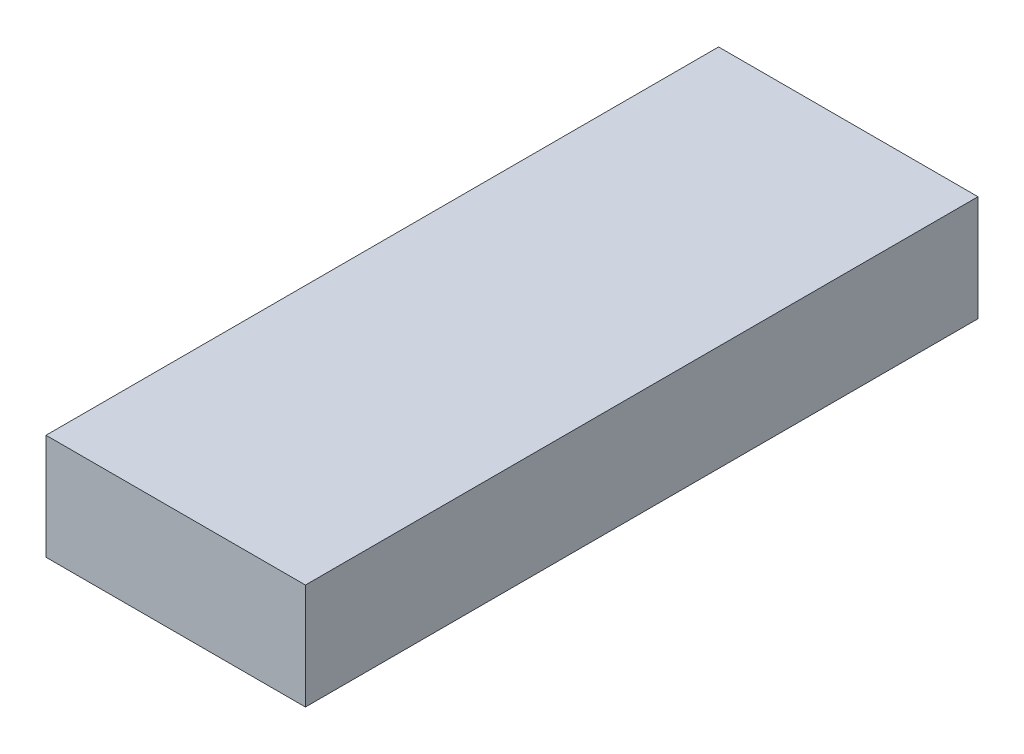
ISO-10303-21;
HEADER;
FILE_DESCRIPTION(('STEP AP214'),'2;1');
FILE_NAME('part.step','',(''),(''),'','','');
FILE_SCHEMA(('AUTOMOTIVE_DESIGN { 1 0 10303 214 1 1 1 1 }'));
ENDSEC;
DATA;
#1=APPLICATION_CONTEXT('core data for automotive mechanical design processes');
#2=APPLICATION_PROTOCOL_DEFINITION('international standard','automotive_design',2000,#1);
#3=PRODUCT_CONTEXT('',#1,'mechanical');
#4=PRODUCT('Part','Part','',(#3));
#5=PRODUCT_RELATED_PRODUCT_CATEGORY('part','',(#4));
#6=PRODUCT_DEFINITION_FORMATION('','',#4);
#7=PRODUCT_DEFINITION_CONTEXT('part definition',#1,'design');
#8=PRODUCT_DEFINITION('design','',#6,#7);
#9=PRODUCT_DEFINITION_SHAPE('','',#8);
#10=(LENGTH_UNIT() NAMED_UNIT(*) SI_UNIT(.MILLI.,.METRE.));
#11=(NAMED_UNIT(*) PLANE_ANGLE_UNIT() SI_UNIT($,.RADIAN.));
#12=(NAMED_UNIT(*) SI_UNIT($,.STERADIAN.) SOLID_ANGLE_UNIT());
#13=UNCERTAINTY_MEASURE_WITH_UNIT(LENGTH_MEASURE(1.E-05),#10,'distance_accuracy_value','');
#14=(GEOMETRIC_REPRESENTATION_CONTEXT(3) GLOBAL_UNCERTAINTY_ASSIGNED_CONTEXT((#13)) GLOBAL_UNIT_ASSIGNED_CONTEXT((#10,
#11,#12)) REPRESENTATION_CONTEXT('',''));
#15=CARTESIAN_POINT('',(0.,0.,0.));
#16=DIRECTION('',(0.,0.,1.));
#17=DIRECTION('',(1.,0.,0.));
#18=AXIS2_PLACEMENT_3D('',#15,#16,#17);
#19=CARTESIAN_POINT('',(-13.5,11.,-35.));
#20=DIRECTION('',(1.,0.,0.));
#21=DIRECTION('',(0.,0.,-1.));
#22=AXIS2_PLACEMENT_3D('',#19,#20,#21);
#23=PLANE('',#22);
#24=DIRECTION('',(0.,0.,1.));
#25=VECTOR('',#24,1.);
#26=CARTESIAN_POINT('',(-13.5,0.,-35.));
#27=LINE('',#26,#25);
#28=CARTESIAN_POINT('',(-13.5,0.,-35.));
#29=VERTEX_POINT('',#28);
#30=CARTESIAN_POINT('',(-13.5,0.,35.));
#31=VERTEX_POINT('',#30);
#32=EDGE_CURVE('E98',#29,#31,#27,.T.);
#33=ORIENTED_EDGE('',*,*,#32,.T.);
#34=DIRECTION('',(0.,-1.,0.));
#35=VECTOR('',#34,1.);
#36=CARTESIAN_POINT('',(-13.5,11.,35.));
#37=LINE('',#36,#35);
#38=CARTESIAN_POINT('',(-13.5,11.,35.));
#39=VERTEX_POINT('',#38);
#40=EDGE_CURVE('E11',#39,#31,#37,.T.);
#41=ORIENTED_EDGE('',*,*,#40,.F.);
#42=DIRECTION('',(0.,0.,1.));
#43=VECTOR('',#42,1.);
#44=CARTESIAN_POINT('',(-13.5,11.,-35.));
#45=LINE('',#44,#43);
#46=CARTESIAN_POINT('',(-13.5,11.,-35.));
#47=VERTEX_POINT('',#46);
#48=EDGE_CURVE('E86',#47,#39,#45,.T.);
#49=ORIENTED_EDGE('',*,*,#48,.F.);
#50=DIRECTION('',(0.,-1.,0.));
#51=VECTOR('',#50,1.);
#52=CARTESIAN_POINT('',(-13.5,11.,-35.));
#53=LINE('',#52,#51);
#54=EDGE_CURVE('E94',#47,#29,#53,.T.);
#55=ORIENTED_EDGE('',*,*,#54,.T.);
#56=EDGE_LOOP('',(#33,#41,#49,#55));
#57=FACE_BOUND('',#56,.T.);
#58=ADVANCED_FACE('F35',(#57),#23,.F.);
#59=CARTESIAN_POINT('',(-13.5,11.,35.));
#60=DIRECTION('',(0.,0.,-1.));
#61=DIRECTION('',(-1.,0.,0.));
#62=AXIS2_PLACEMENT_3D('',#59,#60,#61);
#63=PLANE('',#62);
#64=DIRECTION('',(1.,0.,0.));
#65=VECTOR('',#64,1.);
#66=CARTESIAN_POINT('',(-13.5,0.,35.));
#67=LINE('',#66,#65);
#68=CARTESIAN_POINT('',(13.5,0.,35.));
#69=VERTEX_POINT('',#68);
#70=EDGE_CURVE('E90',#31,#69,#67,.T.);
#71=ORIENTED_EDGE('',*,*,#70,.T.);
#72=DIRECTION('',(0.,-1.,0.));
#73=VECTOR('',#72,1.);
#74=CARTESIAN_POINT('',(13.5,11.,35.));
#75=LINE('',#74,#73);
#76=CARTESIAN_POINT('',(13.5,11.,35.));
#77=VERTEX_POINT('',#76);
#78=EDGE_CURVE('E43',#77,#69,#75,.T.);
#79=ORIENTED_EDGE('',*,*,#78,.F.);
#80=DIRECTION('',(1.,0.,0.));
#81=VECTOR('',#80,1.);
#82=CARTESIAN_POINT('',(-13.5,11.,35.));
#83=LINE('',#82,#81);
#84=EDGE_CURVE('E81',#39,#77,#83,.T.);
#85=ORIENTED_EDGE('',*,*,#84,.F.);
#86=ORIENTED_EDGE('',*,*,#40,.T.);
#87=EDGE_LOOP('',(#71,#79,#85,#86));
#88=FACE_BOUND('',#87,.T.);
#89=ADVANCED_FACE('F89',(#88),#63,.F.);
#90=CARTESIAN_POINT('',(13.5,11.,-35.));
#91=DIRECTION('',(-1.,0.,0.));
#92=DIRECTION('',(0.,0.,1.));
#93=AXIS2_PLACEMENT_3D('',#90,#91,#92);
#94=PLANE('',#93);
#95=DIRECTION('',(0.,0.,-1.));
#96=VECTOR('',#95,1.);
#97=CARTESIAN_POINT('',(13.5,0.,-35.));
#98=LINE('',#97,#96);
#99=CARTESIAN_POINT('',(13.5,0.,-35.));
#100=VERTEX_POINT('',#99);
#101=EDGE_CURVE('E68',#69,#100,#98,.T.);
#102=ORIENTED_EDGE('',*,*,#101,.T.);
#103=DIRECTION('',(0.,-1.,0.));
#104=VECTOR('',#103,1.);
#105=CARTESIAN_POINT('',(13.5,11.,-35.));
#106=LINE('',#105,#104);
#107=CARTESIAN_POINT('',(13.5,11.,-35.));
#108=VERTEX_POINT('',#107);
#109=EDGE_CURVE('E91',#108,#100,#106,.T.);
#110=ORIENTED_EDGE('',*,*,#109,.F.);
#111=DIRECTION('',(0.,0.,-1.));
#112=VECTOR('',#111,1.);
#113=CARTESIAN_POINT('',(13.5,11.,-35.));
#114=LINE('',#113,#112);
#115=EDGE_CURVE('E84',#77,#108,#114,.T.);
#116=ORIENTED_EDGE('',*,*,#115,.F.);
#117=ORIENTED_EDGE('',*,*,#78,.T.);
#118=EDGE_LOOP('',(#102,#110,#116,#117));
#119=FACE_BOUND('',#118,.T.);
#120=ADVANCED_FACE('F92',(#119),#94,.F.);
#121=CARTESIAN_POINT('',(-13.5,11.,-35.));
#122=DIRECTION('',(0.,0.,1.));
#123=DIRECTION('',(1.,0.,0.));
#124=AXIS2_PLACEMENT_3D('',#121,#122,#123);
#125=PLANE('',#124);
#126=DIRECTION('',(-1.,0.,0.));
#127=VECTOR('',#126,1.);
#128=CARTESIAN_POINT('',(-13.5,0.,-35.));
#129=LINE('',#128,#127);
#130=EDGE_CURVE('E74',#100,#29,#129,.T.);
#131=ORIENTED_EDGE('',*,*,#130,.T.);
#132=ORIENTED_EDGE('',*,*,#54,.F.);
#133=DIRECTION('',(-1.,0.,0.));
#134=VECTOR('',#133,1.);
#135=CARTESIAN_POINT('',(-13.5,11.,-35.));
#136=LINE('',#135,#134);
#137=EDGE_CURVE('E51',#108,#47,#136,.T.);
#138=ORIENTED_EDGE('',*,*,#137,.F.);
#139=ORIENTED_EDGE('',*,*,#109,.T.);
#140=EDGE_LOOP('',(#131,#132,#138,#139));
#141=FACE_BOUND('',#140,.T.);
#142=ADVANCED_FACE('F105',(#141),#125,.F.);
#143=CARTESIAN_POINT('',(0.,11.,0.));
#144=DIRECTION('',(0.,1.,0.));
#145=DIRECTION('',(0.,0.,1.));
#146=AXIS2_PLACEMENT_3D('',#143,#144,#145);
#147=PLANE('',#146);
#148=ORIENTED_EDGE('',*,*,#48,.T.);
#149=ORIENTED_EDGE('',*,*,#84,.T.);
#150=ORIENTED_EDGE('',*,*,#115,.T.);
#151=ORIENTED_EDGE('',*,*,#137,.T.);
#152=EDGE_LOOP('',(#148,#149,#150,#151));
#153=FACE_BOUND('',#152,.T.);
#154=ADVANCED_FACE('F82',(#153),#147,.T.);
#155=CARTESIAN_POINT('',(0.,0.,0.));
#156=DIRECTION('',(0.,1.,0.));
#157=DIRECTION('',(0.,0.,1.));
#158=AXIS2_PLACEMENT_3D('',#155,#156,#157);
#159=PLANE('',#158);
#160=ORIENTED_EDGE('',*,*,#32,.F.);
#161=ORIENTED_EDGE('',*,*,#130,.F.);
#162=ORIENTED_EDGE('',*,*,#101,.F.);
#163=ORIENTED_EDGE('',*,*,#70,.F.);
#164=EDGE_LOOP('',(#160,#161,#162,#163));
#165=FACE_BOUND('',#164,.T.);
#166=ADVANCED_FACE('F108',(#165),#159,.F.);
#167=CLOSED_SHELL('',(#58,#89,#120,#142,#154,#166));
#168=MANIFOLD_SOLID_BREP('B2',#167);
#169=ADVANCED_BREP_SHAPE_REPRESENTATION('',(#18,#168),#14);
#170=SHAPE_DEFINITION_REPRESENTATION(#9,#169);
ENDSEC;
END-ISO-10303-21;
